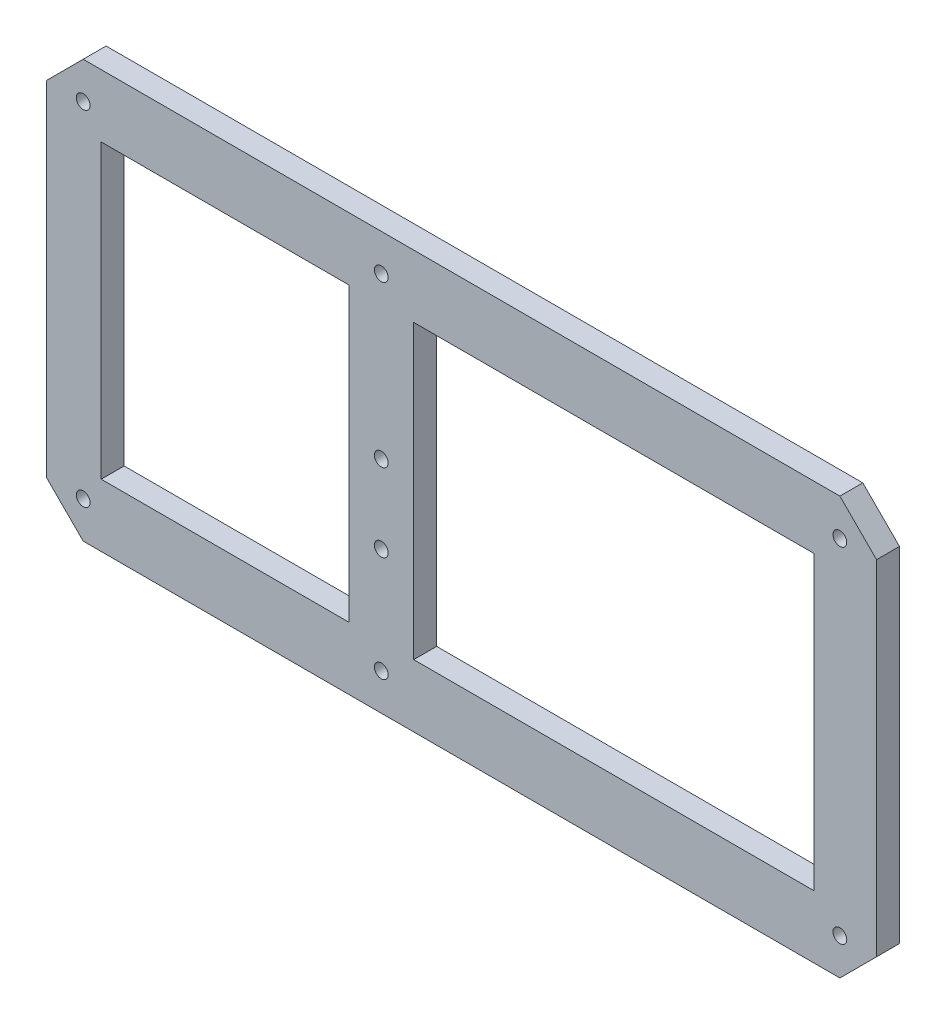
ISO-10303-21;
HEADER;
FILE_DESCRIPTION(('STEP AP214'),'2;1');
FILE_NAME('part.step','',(''),(''),'','','');
FILE_SCHEMA(('AUTOMOTIVE_DESIGN { 1 0 10303 214 1 1 1 1 }'));
ENDSEC;
DATA;
#1=APPLICATION_CONTEXT('core data for automotive mechanical design processes');
#2=APPLICATION_PROTOCOL_DEFINITION('international standard','automotive_design',2000,#1);
#3=PRODUCT_CONTEXT('',#1,'mechanical');
#4=PRODUCT('Part','Part','',(#3));
#5=PRODUCT_RELATED_PRODUCT_CATEGORY('part','',(#4));
#6=PRODUCT_DEFINITION_FORMATION('','',#4);
#7=PRODUCT_DEFINITION_CONTEXT('part definition',#1,'design');
#8=PRODUCT_DEFINITION('design','',#6,#7);
#9=PRODUCT_DEFINITION_SHAPE('','',#8);
#10=(LENGTH_UNIT() NAMED_UNIT(*) SI_UNIT(.MILLI.,.METRE.));
#11=(NAMED_UNIT(*) PLANE_ANGLE_UNIT() SI_UNIT($,.RADIAN.));
#12=(NAMED_UNIT(*) SI_UNIT($,.STERADIAN.) SOLID_ANGLE_UNIT());
#13=UNCERTAINTY_MEASURE_WITH_UNIT(LENGTH_MEASURE(1.E-05),#10,'distance_accuracy_value','');
#14=(GEOMETRIC_REPRESENTATION_CONTEXT(3) GLOBAL_UNCERTAINTY_ASSIGNED_CONTEXT((#13)) GLOBAL_UNIT_ASSIGNED_CONTEXT((#10,
#11,#12)) REPRESENTATION_CONTEXT('',''));
#15=CARTESIAN_POINT('',(0.,0.,0.));
#16=DIRECTION('',(0.,0.,1.));
#17=DIRECTION('',(1.,0.,0.));
#18=AXIS2_PLACEMENT_3D('',#15,#16,#17);
#19=CARTESIAN_POINT('',(0.,-41.9670135344824,5.));
#20=DIRECTION('',(0.,1.,0.));
#21=DIRECTION('',(-1.,0.,0.));
#22=AXIS2_PLACEMENT_3D('',#19,#20,#21);
#23=PLANE('',#22);
#24=DIRECTION('',(1.,0.,0.));
#25=VECTOR('',#24,1.);
#26=CARTESIAN_POINT('',(0.,-41.9670135344824,0.));
#27=LINE('',#26,#25);
#28=CARTESIAN_POINT('',(-68.7558265529049,-41.9670135344824,0.));
#29=VERTEX_POINT('',#28);
#30=CARTESIAN_POINT('',(96.2441734470951,-41.9670135344824,0.));
#31=VERTEX_POINT('',#30);
#32=EDGE_CURVE('E239',#29,#31,#27,.T.);
#33=ORIENTED_EDGE('',*,*,#32,.T.);
#34=DIRECTION('',(0.,0.,-1.));
#35=VECTOR('',#34,1.);
#36=CARTESIAN_POINT('',(96.2441734470951,-41.9670135344824,5.));
#37=LINE('',#36,#35);
#38=CARTESIAN_POINT('',(96.2441734470951,-41.9670135344824,5.));
#39=VERTEX_POINT('',#38);
#40=EDGE_CURVE('E11',#39,#31,#37,.T.);
#41=ORIENTED_EDGE('',*,*,#40,.F.);
#42=DIRECTION('',(1.,0.,0.));
#43=VECTOR('',#42,1.);
#44=CARTESIAN_POINT('',(0.,-41.9670135344824,5.));
#45=LINE('',#44,#43);
#46=CARTESIAN_POINT('',(-68.7558265529049,-41.9670135344824,5.));
#47=VERTEX_POINT('',#46);
#48=EDGE_CURVE('E439',#47,#39,#45,.T.);
#49=ORIENTED_EDGE('',*,*,#48,.F.);
#50=DIRECTION('',(0.,0.,-1.));
#51=VECTOR('',#50,1.);
#52=CARTESIAN_POINT('',(-68.7558265529049,-41.9670135344824,5.));
#53=LINE('',#52,#51);
#54=EDGE_CURVE('E258',#47,#29,#53,.T.);
#55=ORIENTED_EDGE('',*,*,#54,.T.);
#56=EDGE_LOOP('',(#33,#41,#49,#55));
#57=FACE_BOUND('',#56,.T.);
#58=ADVANCED_FACE('F43',(#57),#23,.F.);
#59=CARTESIAN_POINT('',(69.1055934907903,-69.1055934907881,5.));
#60=DIRECTION('',(-0.707106781186559,0.707106781186536,0.));
#61=DIRECTION('',(-0.707106781186536,-0.707106781186559,0.));
#62=AXIS2_PLACEMENT_3D('',#59,#60,#61);
#63=PLANE('',#62);
#64=DIRECTION('',(0.707106781186536,0.707106781186559,0.));
#65=VECTOR('',#64,1.);
#66=CARTESIAN_POINT('',(69.1055934907903,-69.1055934907881,0.));
#67=LINE('',#66,#65);
#68=CARTESIAN_POINT('',(104.244173447095,-33.9670135344821,0.));
#69=VERTEX_POINT('',#68);
#70=EDGE_CURVE('E242',#31,#69,#67,.T.);
#71=ORIENTED_EDGE('',*,*,#70,.T.);
#72=DIRECTION('',(0.,0.,-1.));
#73=VECTOR('',#72,1.);
#74=CARTESIAN_POINT('',(104.244173447095,-33.9670135344821,5.));
#75=LINE('',#74,#73);
#76=CARTESIAN_POINT('',(104.244173447095,-33.9670135344821,5.));
#77=VERTEX_POINT('',#76);
#78=EDGE_CURVE('E53',#77,#69,#75,.T.);
#79=ORIENTED_EDGE('',*,*,#78,.F.);
#80=DIRECTION('',(0.707106781186536,0.707106781186559,0.));
#81=VECTOR('',#80,1.);
#82=CARTESIAN_POINT('',(69.1055934907903,-69.1055934907881,5.));
#83=LINE('',#82,#81);
#84=EDGE_CURVE('E435',#39,#77,#83,.T.);
#85=ORIENTED_EDGE('',*,*,#84,.F.);
#86=ORIENTED_EDGE('',*,*,#40,.T.);
#87=EDGE_LOOP('',(#71,#79,#85,#86));
#88=FACE_BOUND('',#87,.T.);
#89=ADVANCED_FACE('F312',(#88),#63,.F.);
#90=CARTESIAN_POINT('',(104.244173447095,0.,5.));
#91=DIRECTION('',(1.,0.,0.));
#92=DIRECTION('',(0.,1.,0.));
#93=AXIS2_PLACEMENT_3D('',#90,#91,#92);
#94=PLANE('',#93);
#95=DIRECTION('',(0.,-1.,0.));
#96=VECTOR('',#95,1.);
#97=CARTESIAN_POINT('',(104.244173447095,0.,0.));
#98=LINE('',#97,#96);
#99=CARTESIAN_POINT('',(104.244173447095,41.0329864655178,0.));
#100=VERTEX_POINT('',#99);
#101=EDGE_CURVE('E245',#100,#69,#98,.T.);
#102=ORIENTED_EDGE('',*,*,#101,.F.);
#103=DIRECTION('',(0.,0.,-1.));
#104=VECTOR('',#103,1.);
#105=CARTESIAN_POINT('',(104.244173447095,41.0329864655178,5.));
#106=LINE('',#105,#104);
#107=CARTESIAN_POINT('',(104.244173447095,41.0329864655178,5.));
#108=VERTEX_POINT('',#107);
#109=EDGE_CURVE('E265',#108,#100,#106,.T.);
#110=ORIENTED_EDGE('',*,*,#109,.F.);
#111=DIRECTION('',(0.,-1.,0.));
#112=VECTOR('',#111,1.);
#113=CARTESIAN_POINT('',(104.244173447095,0.,5.));
#114=LINE('',#113,#112);
#115=EDGE_CURVE('E433',#108,#77,#114,.T.);
#116=ORIENTED_EDGE('',*,*,#115,.T.);
#117=ORIENTED_EDGE('',*,*,#78,.T.);
#118=EDGE_LOOP('',(#102,#110,#116,#117));
#119=FACE_BOUND('',#118,.T.);
#120=ADVANCED_FACE('F318',(#119),#94,.T.);
#121=CARTESIAN_POINT('',(72.6385799563055,72.6385799563068,5.));
#122=DIRECTION('',(0.707106781186541,0.707106781186554,0.));
#123=DIRECTION('',(-0.707106781186554,0.707106781186541,0.));
#124=AXIS2_PLACEMENT_3D('',#121,#122,#123);
#125=PLANE('',#124);
#126=DIRECTION('',(0.707106781186554,-0.707106781186541,0.));
#127=VECTOR('',#126,1.);
#128=CARTESIAN_POINT('',(72.6385799563055,72.6385799563068,0.));
#129=LINE('',#128,#127);
#130=CARTESIAN_POINT('',(96.2441734470951,49.0329864655176,0.));
#131=VERTEX_POINT('',#130);
#132=EDGE_CURVE('E248',#131,#100,#129,.T.);
#133=ORIENTED_EDGE('',*,*,#132,.F.);
#134=DIRECTION('',(0.,0.,-1.));
#135=VECTOR('',#134,1.);
#136=CARTESIAN_POINT('',(96.2441734470951,49.0329864655176,5.));
#137=LINE('',#136,#135);
#138=CARTESIAN_POINT('',(96.2441734470951,49.0329864655176,5.));
#139=VERTEX_POINT('',#138);
#140=EDGE_CURVE('E263',#139,#131,#137,.T.);
#141=ORIENTED_EDGE('',*,*,#140,.F.);
#142=DIRECTION('',(0.707106781186554,-0.707106781186541,0.));
#143=VECTOR('',#142,1.);
#144=CARTESIAN_POINT('',(72.6385799563055,72.6385799563068,5.));
#145=LINE('',#144,#143);
#146=EDGE_CURVE('E432',#139,#108,#145,.T.);
#147=ORIENTED_EDGE('',*,*,#146,.T.);
#148=ORIENTED_EDGE('',*,*,#109,.T.);
#149=EDGE_LOOP('',(#133,#141,#147,#148));
#150=FACE_BOUND('',#149,.T.);
#151=ADVANCED_FACE('F415',(#150),#125,.T.);
#152=CARTESIAN_POINT('',(0.,49.0329864655176,5.));
#153=DIRECTION('',(0.,1.,0.));
#154=DIRECTION('',(-1.,0.,0.));
#155=AXIS2_PLACEMENT_3D('',#152,#153,#154);
#156=PLANE('',#155);
#157=DIRECTION('',(1.,0.,0.));
#158=VECTOR('',#157,1.);
#159=CARTESIAN_POINT('',(0.,49.0329864655176,0.));
#160=LINE('',#159,#158);
#161=CARTESIAN_POINT('',(-68.7558265529048,49.0329864655176,0.));
#162=VERTEX_POINT('',#161);
#163=EDGE_CURVE('E251',#162,#131,#160,.T.);
#164=ORIENTED_EDGE('',*,*,#163,.F.);
#165=DIRECTION('',(0.,0.,-1.));
#166=VECTOR('',#165,1.);
#167=CARTESIAN_POINT('',(-68.7558265529048,49.0329864655176,5.));
#168=LINE('',#167,#166);
#169=CARTESIAN_POINT('',(-68.7558265529048,49.0329864655176,5.));
#170=VERTEX_POINT('',#169);
#171=EDGE_CURVE('E182',#170,#162,#168,.T.);
#172=ORIENTED_EDGE('',*,*,#171,.F.);
#173=DIRECTION('',(1.,0.,0.));
#174=VECTOR('',#173,1.);
#175=CARTESIAN_POINT('',(0.,49.0329864655176,5.));
#176=LINE('',#175,#174);
#177=EDGE_CURVE('E175',#170,#139,#176,.T.);
#178=ORIENTED_EDGE('',*,*,#177,.T.);
#179=ORIENTED_EDGE('',*,*,#140,.T.);
#180=EDGE_LOOP('',(#164,#172,#178,#179));
#181=FACE_BOUND('',#180,.T.);
#182=ADVANCED_FACE('F412',(#181),#156,.T.);
#183=CARTESIAN_POINT('',(-58.8944065092109,58.8944065092115,5.));
#184=DIRECTION('',(0.707106781186544,-0.707106781186551,0.));
#185=DIRECTION('',(0.707106781186551,0.707106781186544,0.));
#186=AXIS2_PLACEMENT_3D('',#183,#184,#185);
#187=PLANE('',#186);
#188=DIRECTION('',(-0.707106781186551,-0.707106781186544,0.));
#189=VECTOR('',#188,1.);
#190=CARTESIAN_POINT('',(-58.8944065092109,58.8944065092115,0.));
#191=LINE('',#190,#189);
#192=CARTESIAN_POINT('',(-76.7558205432151,41.0329924752074,0.));
#193=VERTEX_POINT('',#192);
#194=EDGE_CURVE('E181',#162,#193,#191,.T.);
#195=ORIENTED_EDGE('',*,*,#194,.T.);
#196=DIRECTION('',(0.,0.,-1.));
#197=VECTOR('',#196,1.);
#198=CARTESIAN_POINT('',(-76.7558205432151,41.0329924752074,5.));
#199=LINE('',#198,#197);
#200=CARTESIAN_POINT('',(-76.7558205432151,41.0329924752074,5.));
#201=VERTEX_POINT('',#200);
#202=EDGE_CURVE('E178',#201,#193,#199,.T.);
#203=ORIENTED_EDGE('',*,*,#202,.F.);
#204=DIRECTION('',(-0.707106781186551,-0.707106781186544,0.));
#205=VECTOR('',#204,1.);
#206=CARTESIAN_POINT('',(-58.8944065092109,58.8944065092115,5.));
#207=LINE('',#206,#205);
#208=EDGE_CURVE('E168',#170,#201,#207,.T.);
#209=ORIENTED_EDGE('',*,*,#208,.F.);
#210=ORIENTED_EDGE('',*,*,#171,.T.);
#211=EDGE_LOOP('',(#195,#203,#209,#210));
#212=FACE_BOUND('',#211,.T.);
#213=ADVANCED_FACE('F179',(#212),#187,.F.);
#214=CARTESIAN_POINT('',(-76.7558205432151,0.,5.));
#215=DIRECTION('',(1.,0.,0.));
#216=DIRECTION('',(0.,1.,0.));
#217=AXIS2_PLACEMENT_3D('',#214,#215,#216);
#218=PLANE('',#217);
#219=DIRECTION('',(0.,-1.,0.));
#220=VECTOR('',#219,1.);
#221=CARTESIAN_POINT('',(-76.7558205432151,0.,0.));
#222=LINE('',#221,#220);
#223=CARTESIAN_POINT('',(-76.7558205432151,-33.9670075247925,0.));
#224=VERTEX_POINT('',#223);
#225=EDGE_CURVE('E115',#193,#224,#222,.T.);
#226=ORIENTED_EDGE('',*,*,#225,.T.);
#227=DIRECTION('',(0.,0.,-1.));
#228=VECTOR('',#227,1.);
#229=CARTESIAN_POINT('',(-76.7558205432151,-33.9670075247925,5.));
#230=LINE('',#229,#228);
#231=CARTESIAN_POINT('',(-76.7558205432151,-33.9670075247925,5.));
#232=VERTEX_POINT('',#231);
#233=EDGE_CURVE('E183',#232,#224,#230,.T.);
#234=ORIENTED_EDGE('',*,*,#233,.F.);
#235=DIRECTION('',(0.,-1.,0.));
#236=VECTOR('',#235,1.);
#237=CARTESIAN_POINT('',(-76.7558205432151,0.,5.));
#238=LINE('',#237,#236);
#239=EDGE_CURVE('E172',#201,#232,#238,.T.);
#240=ORIENTED_EDGE('',*,*,#239,.F.);
#241=ORIENTED_EDGE('',*,*,#202,.T.);
#242=EDGE_LOOP('',(#226,#234,#240,#241));
#243=FACE_BOUND('',#242,.T.);
#244=ADVANCED_FACE('F185',(#243),#218,.F.);
#245=CARTESIAN_POINT('',(-10.8268943647704,0.,5.));
#246=DIRECTION('',(-1.,0.,0.));
#247=DIRECTION('',(0.,-1.,0.));
#248=AXIS2_PLACEMENT_3D('',#245,#246,#247);
#249=PLANE('',#248);
#250=DIRECTION('',(0.,1.,0.));
#251=VECTOR('',#250,1.);
#252=CARTESIAN_POINT('',(-10.8268943647704,0.,0.));
#253=LINE('',#252,#251);
#254=CARTESIAN_POINT('',(-10.8268943647704,-28.31015928499,0.));
#255=VERTEX_POINT('',#254);
#256=CARTESIAN_POINT('',(-10.8268943647704,35.3761322160252,0.));
#257=VERTEX_POINT('',#256);
#258=EDGE_CURVE('E227',#255,#257,#253,.T.);
#259=ORIENTED_EDGE('',*,*,#258,.F.);
#260=DIRECTION('',(0.,0.,-1.));
#261=VECTOR('',#260,1.);
#262=CARTESIAN_POINT('',(-10.8268943647704,-28.31015928499,5.));
#263=LINE('',#262,#261);
#264=CARTESIAN_POINT('',(-10.8268943647704,-28.31015928499,5.));
#265=VERTEX_POINT('',#264);
#266=EDGE_CURVE('E260',#265,#255,#263,.T.);
#267=ORIENTED_EDGE('',*,*,#266,.F.);
#268=DIRECTION('',(0.,1.,0.));
#269=VECTOR('',#268,1.);
#270=CARTESIAN_POINT('',(-10.8268943647704,0.,5.));
#271=LINE('',#270,#269);
#272=CARTESIAN_POINT('',(-10.8268943647704,35.3761322160252,5.));
#273=VERTEX_POINT('',#272);
#274=EDGE_CURVE('E449',#265,#273,#271,.T.);
#275=ORIENTED_EDGE('',*,*,#274,.T.);
#276=DIRECTION('',(0.,0.,-1.));
#277=VECTOR('',#276,1.);
#278=CARTESIAN_POINT('',(-10.8268943647704,35.3761322160252,5.));
#279=LINE('',#278,#277);
#280=EDGE_CURVE('E268',#273,#257,#279,.T.);
#281=ORIENTED_EDGE('',*,*,#280,.T.);
#282=EDGE_LOOP('',(#259,#267,#275,#281));
#283=FACE_BOUND('',#282,.T.);
#284=ADVANCED_FACE('F330',(#283),#249,.T.);
#285=CARTESIAN_POINT('',(0.,-28.31015928499,5.));
#286=DIRECTION('',(0.,1.,0.));
#287=DIRECTION('',(0.,0.,1.));
#288=AXIS2_PLACEMENT_3D('',#285,#286,#287);
#289=PLANE('',#288);
#290=DIRECTION('',(1.,0.,0.));
#291=VECTOR('',#290,1.);
#292=CARTESIAN_POINT('',(0.,-28.31015928499,0.));
#293=LINE('',#292,#291);
#294=CARTESIAN_POINT('',(-64.8268943647704,-28.31015928499,0.));
#295=VERTEX_POINT('',#294);
#296=EDGE_CURVE('E230',#295,#255,#293,.T.);
#297=ORIENTED_EDGE('',*,*,#296,.F.);
#298=DIRECTION('',(0.,0.,-1.));
#299=VECTOR('',#298,1.);
#300=CARTESIAN_POINT('',(-64.8268943647704,-28.31015928499,5.));
#301=LINE('',#300,#299);
#302=CARTESIAN_POINT('',(-64.8268943647704,-28.31015928499,5.));
#303=VERTEX_POINT('',#302);
#304=EDGE_CURVE('E272',#303,#295,#301,.T.);
#305=ORIENTED_EDGE('',*,*,#304,.F.);
#306=DIRECTION('',(1.,0.,0.));
#307=VECTOR('',#306,1.);
#308=CARTESIAN_POINT('',(0.,-28.31015928499,5.));
#309=LINE('',#308,#307);
#310=EDGE_CURVE('E446',#303,#265,#309,.T.);
#311=ORIENTED_EDGE('',*,*,#310,.T.);
#312=ORIENTED_EDGE('',*,*,#266,.T.);
#313=EDGE_LOOP('',(#297,#305,#311,#312));
#314=FACE_BOUND('',#313,.T.);
#315=ADVANCED_FACE('F326',(#314),#289,.T.);
#316=CARTESIAN_POINT('',(-64.8268943647704,0.,5.));
#317=DIRECTION('',(1.,0.,0.));
#318=DIRECTION('',(0.,0.,-1.));
#319=AXIS2_PLACEMENT_3D('',#316,#317,#318);
#320=PLANE('',#319);
#321=DIRECTION('',(0.,-1.,0.));
#322=VECTOR('',#321,1.);
#323=CARTESIAN_POINT('',(-64.8268943647704,0.,0.));
#324=LINE('',#323,#322);
#325=CARTESIAN_POINT('',(-64.8268943647704,35.3761322160252,0.));
#326=VERTEX_POINT('',#325);
#327=EDGE_CURVE('E233',#326,#295,#324,.T.);
#328=ORIENTED_EDGE('',*,*,#327,.F.);
#329=DIRECTION('',(0.,0.,-1.));
#330=VECTOR('',#329,1.);
#331=CARTESIAN_POINT('',(-64.8268943647704,35.3761322160252,5.));
#332=LINE('',#331,#330);
#333=CARTESIAN_POINT('',(-64.8268943647704,35.3761322160252,5.));
#334=VERTEX_POINT('',#333);
#335=EDGE_CURVE('E270',#334,#326,#332,.T.);
#336=ORIENTED_EDGE('',*,*,#335,.F.);
#337=DIRECTION('',(0.,-1.,0.));
#338=VECTOR('',#337,1.);
#339=CARTESIAN_POINT('',(-64.8268943647704,0.,5.));
#340=LINE('',#339,#338);
#341=EDGE_CURVE('E443',#334,#303,#340,.T.);
#342=ORIENTED_EDGE('',*,*,#341,.T.);
#343=ORIENTED_EDGE('',*,*,#304,.T.);
#344=EDGE_LOOP('',(#328,#336,#342,#343));
#345=FACE_BOUND('',#344,.T.);
#346=ADVANCED_FACE('F323',(#345),#320,.T.);
#347=CARTESIAN_POINT('',(3.31524125896056,0.,5.));
#348=DIRECTION('',(1.,0.,0.));
#349=DIRECTION('',(0.,1.,0.));
#350=AXIS2_PLACEMENT_3D('',#347,#348,#349);
#351=PLANE('',#350);
#352=DIRECTION('',(0.,-1.,0.));
#353=VECTOR('',#352,1.);
#354=CARTESIAN_POINT('',(3.31524125896056,0.,0.));
#355=LINE('',#354,#353);
#356=CARTESIAN_POINT('',(3.31524125896056,35.3761322160252,0.));
#357=VERTEX_POINT('',#356);
#358=CARTESIAN_POINT('',(3.31524125896056,-28.31015928499,0.));
#359=VERTEX_POINT('',#358);
#360=EDGE_CURVE('E215',#357,#359,#355,.T.);
#361=ORIENTED_EDGE('',*,*,#360,.F.);
#362=DIRECTION('',(0.,0.,-1.));
#363=VECTOR('',#362,1.);
#364=CARTESIAN_POINT('',(3.31524125896056,35.3761322160252,5.));
#365=LINE('',#364,#363);
#366=CARTESIAN_POINT('',(3.31524125896056,35.3761322160252,5.));
#367=VERTEX_POINT('',#366);
#368=EDGE_CURVE('E47',#367,#357,#365,.T.);
#369=ORIENTED_EDGE('',*,*,#368,.F.);
#370=DIRECTION('',(0.,-1.,0.));
#371=VECTOR('',#370,1.);
#372=CARTESIAN_POINT('',(3.31524125896056,0.,5.));
#373=LINE('',#372,#371);
#374=CARTESIAN_POINT('',(3.31524125896056,-28.31015928499,5.));
#375=VERTEX_POINT('',#374);
#376=EDGE_CURVE('E292',#367,#375,#373,.T.);
#377=ORIENTED_EDGE('',*,*,#376,.T.);
#378=DIRECTION('',(0.,0.,-1.));
#379=VECTOR('',#378,1.);
#380=CARTESIAN_POINT('',(3.31524125896056,-28.31015928499,5.));
#381=LINE('',#380,#379);
#382=EDGE_CURVE('E187',#375,#359,#381,.T.);
#383=ORIENTED_EDGE('',*,*,#382,.T.);
#384=EDGE_LOOP('',(#361,#369,#377,#383));
#385=FACE_BOUND('',#384,.T.);
#386=ADVANCED_FACE('F291',(#385),#351,.T.);
#387=CARTESIAN_POINT('',(0.,35.3761322160252,5.));
#388=DIRECTION('',(0.,1.,0.));
#389=DIRECTION('',(-1.,0.,0.));
#390=AXIS2_PLACEMENT_3D('',#387,#388,#389);
#391=PLANE('',#390);
#392=DIRECTION('',(1.,0.,0.));
#393=VECTOR('',#392,1.);
#394=CARTESIAN_POINT('',(0.,35.3761322160252,0.));
#395=LINE('',#394,#393);
#396=CARTESIAN_POINT('',(90.5873191976027,35.3761322160252,0.));
#397=VERTEX_POINT('',#396);
#398=EDGE_CURVE('E218',#357,#397,#395,.T.);
#399=ORIENTED_EDGE('',*,*,#398,.T.);
#400=DIRECTION('',(0.,0.,-1.));
#401=VECTOR('',#400,1.);
#402=CARTESIAN_POINT('',(90.5873191976027,35.3761322160252,5.));
#403=LINE('',#402,#401);
#404=CARTESIAN_POINT('',(90.5873191976027,35.3761322160252,5.));
#405=VERTEX_POINT('',#404);
#406=EDGE_CURVE('E277',#405,#397,#403,.T.);
#407=ORIENTED_EDGE('',*,*,#406,.F.);
#408=DIRECTION('',(1.,0.,0.));
#409=VECTOR('',#408,1.);
#410=CARTESIAN_POINT('',(0.,35.3761322160252,5.));
#411=LINE('',#410,#409);
#412=EDGE_CURVE('E285',#367,#405,#411,.T.);
#413=ORIENTED_EDGE('',*,*,#412,.F.);
#414=ORIENTED_EDGE('',*,*,#368,.T.);
#415=EDGE_LOOP('',(#399,#407,#413,#414));
#416=FACE_BOUND('',#415,.T.);
#417=ADVANCED_FACE('F284',(#416),#391,.F.);
#418=CARTESIAN_POINT('',(90.5873191976027,0.,5.));
#419=DIRECTION('',(-1.,0.,0.));
#420=DIRECTION('',(0.,-1.,0.));
#421=AXIS2_PLACEMENT_3D('',#418,#419,#420);
#422=PLANE('',#421);
#423=DIRECTION('',(0.,1.,0.));
#424=VECTOR('',#423,1.);
#425=CARTESIAN_POINT('',(90.5873191976027,0.,0.));
#426=LINE('',#425,#424);
#427=CARTESIAN_POINT('',(90.5873191976027,-28.31015928499,0.));
#428=VERTEX_POINT('',#427);
#429=EDGE_CURVE('E221',#428,#397,#426,.T.);
#430=ORIENTED_EDGE('',*,*,#429,.F.);
#431=DIRECTION('',(0.,0.,-1.));
#432=VECTOR('',#431,1.);
#433=CARTESIAN_POINT('',(90.5873191976027,-28.31015928499,5.));
#434=LINE('',#433,#432);
#435=CARTESIAN_POINT('',(90.5873191976027,-28.31015928499,5.));
#436=VERTEX_POINT('',#435);
#437=EDGE_CURVE('E276',#436,#428,#434,.T.);
#438=ORIENTED_EDGE('',*,*,#437,.F.);
#439=DIRECTION('',(0.,1.,0.));
#440=VECTOR('',#439,1.);
#441=CARTESIAN_POINT('',(90.5873191976027,0.,5.));
#442=LINE('',#441,#440);
#443=EDGE_CURVE('E453',#436,#405,#442,.T.);
#444=ORIENTED_EDGE('',*,*,#443,.T.);
#445=ORIENTED_EDGE('',*,*,#406,.T.);
#446=EDGE_LOOP('',(#430,#438,#444,#445));
#447=FACE_BOUND('',#446,.T.);
#448=ADVANCED_FACE('F299',(#447),#422,.T.);
#449=CARTESIAN_POINT('',(0.,35.3761322160252,5.));
#450=DIRECTION('',(0.,1.,0.));
#451=DIRECTION('',(0.,0.,1.));
#452=AXIS2_PLACEMENT_3D('',#449,#450,#451);
#453=PLANE('',#452);
#454=DIRECTION('',(1.,0.,0.));
#455=VECTOR('',#454,1.);
#456=CARTESIAN_POINT('',(0.,35.3761322160252,0.));
#457=LINE('',#456,#455);
#458=EDGE_CURVE('E236',#326,#257,#457,.T.);
#459=ORIENTED_EDGE('',*,*,#458,.T.);
#460=ORIENTED_EDGE('',*,*,#280,.F.);
#461=DIRECTION('',(1.,0.,0.));
#462=VECTOR('',#461,1.);
#463=CARTESIAN_POINT('',(0.,35.3761322160252,5.));
#464=LINE('',#463,#462);
#465=EDGE_CURVE('E441',#334,#273,#464,.T.);
#466=ORIENTED_EDGE('',*,*,#465,.F.);
#467=ORIENTED_EDGE('',*,*,#335,.T.);
#468=EDGE_LOOP('',(#459,#460,#466,#467));
#469=FACE_BOUND('',#468,.T.);
#470=ADVANCED_FACE('F301',(#469),#453,.F.);
#471=CARTESIAN_POINT('',(0.,-28.31015928499,5.));
#472=DIRECTION('',(0.,1.,0.));
#473=DIRECTION('',(0.,0.,1.));
#474=AXIS2_PLACEMENT_3D('',#471,#472,#473);
#475=PLANE('',#474);
#476=DIRECTION('',(1.,0.,0.));
#477=VECTOR('',#476,1.);
#478=CARTESIAN_POINT('',(0.,-28.31015928499,0.));
#479=LINE('',#478,#477);
#480=EDGE_CURVE('E224',#359,#428,#479,.T.);
#481=ORIENTED_EDGE('',*,*,#480,.F.);
#482=ORIENTED_EDGE('',*,*,#382,.F.);
#483=DIRECTION('',(1.,0.,0.));
#484=VECTOR('',#483,1.);
#485=CARTESIAN_POINT('',(0.,-28.31015928499,5.));
#486=LINE('',#485,#484);
#487=EDGE_CURVE('E297',#375,#436,#486,.T.);
#488=ORIENTED_EDGE('',*,*,#487,.T.);
#489=ORIENTED_EDGE('',*,*,#437,.T.);
#490=EDGE_LOOP('',(#481,#482,#488,#489));
#491=FACE_BOUND('',#490,.T.);
#492=ADVANCED_FACE('F296',(#491),#475,.T.);
#493=CARTESIAN_POINT('',(-3.75582655290491,6.03298646551761,5.));
#494=DIRECTION('',(0.,0.,-1.));
#495=DIRECTION('',(-1.,0.,0.));
#496=AXIS2_PLACEMENT_3D('',#493,#494,#495);
#497=CYLINDRICAL_SURFACE('',#496,1.5);
#498=CARTESIAN_POINT('',(-3.75582655290491,6.03298646551761,5.));
#499=DIRECTION('',(0.,0.,1.));
#500=DIRECTION('',(1.,0.,0.));
#501=AXIS2_PLACEMENT_3D('',#498,#499,#500);
#502=CIRCLE('',#501,1.5);
#503=CARTESIAN_POINT('',(-2.25582655290491,6.03298646551761,5.));
#504=VERTEX_POINT('',#503);
#505=EDGE_CURVE('E457',#504,#504,#502,.T.);
#506=ORIENTED_EDGE('',*,*,#505,.T.);
#507=EDGE_LOOP('',(#506));
#508=FACE_BOUND('',#507,.T.);
#509=CARTESIAN_POINT('',(-3.75582655290491,6.03298646551761,0.));
#510=DIRECTION('',(0.,0.,1.));
#511=DIRECTION('',(1.,0.,0.));
#512=AXIS2_PLACEMENT_3D('',#509,#510,#511);
#513=CIRCLE('',#512,1.5);
#514=CARTESIAN_POINT('',(-2.25582655290491,6.03298646551761,0.));
#515=VERTEX_POINT('',#514);
#516=EDGE_CURVE('E212',#515,#515,#513,.T.);
#517=ORIENTED_EDGE('',*,*,#516,.F.);
#518=EDGE_LOOP('',(#517));
#519=FACE_BOUND('',#518,.T.);
#520=ADVANCED_FACE('F335',(#508,#519),#497,.F.);
#521=CARTESIAN_POINT('',(-3.75582655290491,-10.9670135344824,5.));
#522=DIRECTION('',(0.,0.,-1.));
#523=DIRECTION('',(-1.,0.,0.));
#524=AXIS2_PLACEMENT_3D('',#521,#522,#523);
#525=CYLINDRICAL_SURFACE('',#524,1.5);
#526=CARTESIAN_POINT('',(-3.75582655290491,-10.9670135344824,5.));
#527=DIRECTION('',(0.,0.,1.));
#528=DIRECTION('',(1.,0.,0.));
#529=AXIS2_PLACEMENT_3D('',#526,#527,#528);
#530=CIRCLE('',#529,1.5);
#531=CARTESIAN_POINT('',(-2.25582655290491,-10.9670135344824,5.));
#532=VERTEX_POINT('',#531);
#533=EDGE_CURVE('E459',#532,#532,#530,.T.);
#534=ORIENTED_EDGE('',*,*,#533,.T.);
#535=EDGE_LOOP('',(#534));
#536=FACE_BOUND('',#535,.T.);
#537=CARTESIAN_POINT('',(-3.75582655290491,-10.9670135344824,0.));
#538=DIRECTION('',(0.,0.,1.));
#539=DIRECTION('',(1.,0.,0.));
#540=AXIS2_PLACEMENT_3D('',#537,#538,#539);
#541=CIRCLE('',#540,1.5);
#542=CARTESIAN_POINT('',(-2.25582655290491,-10.9670135344824,0.));
#543=VERTEX_POINT('',#542);
#544=EDGE_CURVE('E209',#543,#543,#541,.T.);
#545=ORIENTED_EDGE('',*,*,#544,.F.);
#546=EDGE_LOOP('',(#545));
#547=FACE_BOUND('',#546,.T.);
#548=ADVANCED_FACE('F339',(#536,#547),#525,.F.);
#549=CARTESIAN_POINT('',(-68.7558265529048,41.0329924752074,5.));
#550=DIRECTION('',(0.,0.,-1.));
#551=DIRECTION('',(-1.,0.,0.));
#552=AXIS2_PLACEMENT_3D('',#549,#550,#551);
#553=CYLINDRICAL_SURFACE('',#552,1.5);
#554=CARTESIAN_POINT('',(-68.7558265529048,41.0329924752074,5.));
#555=DIRECTION('',(0.,0.,1.));
#556=DIRECTION('',(1.,0.,0.));
#557=AXIS2_PLACEMENT_3D('',#554,#555,#556);
#558=CIRCLE('',#557,1.5);
#559=CARTESIAN_POINT('',(-67.2558265529048,41.0329924752074,5.));
#560=VERTEX_POINT('',#559);
#561=EDGE_CURVE('E462',#560,#560,#558,.T.);
#562=ORIENTED_EDGE('',*,*,#561,.T.);
#563=EDGE_LOOP('',(#562));
#564=FACE_BOUND('',#563,.T.);
#565=CARTESIAN_POINT('',(-68.7558265529048,41.0329924752074,0.));
#566=DIRECTION('',(0.,0.,1.));
#567=DIRECTION('',(1.,0.,0.));
#568=AXIS2_PLACEMENT_3D('',#565,#566,#567);
#569=CIRCLE('',#568,1.5);
#570=CARTESIAN_POINT('',(-67.2558265529048,41.0329924752074,0.));
#571=VERTEX_POINT('',#570);
#572=EDGE_CURVE('E206',#571,#571,#569,.T.);
#573=ORIENTED_EDGE('',*,*,#572,.F.);
#574=EDGE_LOOP('',(#573));
#575=FACE_BOUND('',#574,.T.);
#576=ADVANCED_FACE('F345',(#564,#575),#553,.F.);
#577=CARTESIAN_POINT('',(-3.75582655290491,41.0329864655176,5.));
#578=DIRECTION('',(0.,0.,-1.));
#579=DIRECTION('',(-1.,0.,0.));
#580=AXIS2_PLACEMENT_3D('',#577,#578,#579);
#581=CYLINDRICAL_SURFACE('',#580,1.5);
#582=CARTESIAN_POINT('',(-3.75582655290491,41.0329864655176,5.));
#583=DIRECTION('',(0.,0.,1.));
#584=DIRECTION('',(1.,0.,0.));
#585=AXIS2_PLACEMENT_3D('',#582,#583,#584);
#586=CIRCLE('',#585,1.5);
#587=CARTESIAN_POINT('',(-2.25582655290491,41.0329864655176,5.));
#588=VERTEX_POINT('',#587);
#589=EDGE_CURVE('E465',#588,#588,#586,.T.);
#590=ORIENTED_EDGE('',*,*,#589,.T.);
#591=EDGE_LOOP('',(#590));
#592=FACE_BOUND('',#591,.T.);
#593=CARTESIAN_POINT('',(-3.75582655290491,41.0329864655176,0.));
#594=DIRECTION('',(0.,0.,1.));
#595=DIRECTION('',(1.,0.,0.));
#596=AXIS2_PLACEMENT_3D('',#593,#594,#595);
#597=CIRCLE('',#596,1.5);
#598=CARTESIAN_POINT('',(-2.25582655290491,41.0329864655176,0.));
#599=VERTEX_POINT('',#598);
#600=EDGE_CURVE('E203',#599,#599,#597,.T.);
#601=ORIENTED_EDGE('',*,*,#600,.F.);
#602=EDGE_LOOP('',(#601));
#603=FACE_BOUND('',#602,.T.);
#604=ADVANCED_FACE('F354',(#592,#603),#581,.F.);
#605=CARTESIAN_POINT('',(-3.7558265529049,-33.9670135344824,5.));
#606=DIRECTION('',(0.,0.,-1.));
#607=DIRECTION('',(-1.,0.,0.));
#608=AXIS2_PLACEMENT_3D('',#605,#606,#607);
#609=CYLINDRICAL_SURFACE('',#608,1.5);
#610=CARTESIAN_POINT('',(-3.7558265529049,-33.9670135344824,5.));
#611=DIRECTION('',(0.,0.,1.));
#612=DIRECTION('',(1.,0.,0.));
#613=AXIS2_PLACEMENT_3D('',#610,#611,#612);
#614=CIRCLE('',#613,1.5);
#615=CARTESIAN_POINT('',(-2.2558265529049,-33.9670135344824,5.));
#616=VERTEX_POINT('',#615);
#617=EDGE_CURVE('E468',#616,#616,#614,.T.);
#618=ORIENTED_EDGE('',*,*,#617,.T.);
#619=EDGE_LOOP('',(#618));
#620=FACE_BOUND('',#619,.T.);
#621=CARTESIAN_POINT('',(-3.7558265529049,-33.9670135344824,0.));
#622=DIRECTION('',(0.,0.,1.));
#623=DIRECTION('',(1.,0.,0.));
#624=AXIS2_PLACEMENT_3D('',#621,#622,#623);
#625=CIRCLE('',#624,1.5);
#626=CARTESIAN_POINT('',(-2.2558265529049,-33.9670135344824,0.));
#627=VERTEX_POINT('',#626);
#628=EDGE_CURVE('E200',#627,#627,#625,.T.);
#629=ORIENTED_EDGE('',*,*,#628,.F.);
#630=EDGE_LOOP('',(#629));
#631=FACE_BOUND('',#630,.T.);
#632=ADVANCED_FACE('F358',(#620,#631),#609,.F.);
#633=CARTESIAN_POINT('',(-68.7558265529049,-33.9670075247925,5.));
#634=DIRECTION('',(0.,0.,-1.));
#635=DIRECTION('',(-1.,0.,0.));
#636=AXIS2_PLACEMENT_3D('',#633,#634,#635);
#637=CYLINDRICAL_SURFACE('',#636,1.5);
#638=CARTESIAN_POINT('',(-68.7558265529049,-33.9670075247925,5.));
#639=DIRECTION('',(0.,0.,1.));
#640=DIRECTION('',(1.,0.,0.));
#641=AXIS2_PLACEMENT_3D('',#638,#639,#640);
#642=CIRCLE('',#641,1.5);
#643=CARTESIAN_POINT('',(-67.2558265529049,-33.9670075247925,5.));
#644=VERTEX_POINT('',#643);
#645=EDGE_CURVE('E471',#644,#644,#642,.T.);
#646=ORIENTED_EDGE('',*,*,#645,.T.);
#647=EDGE_LOOP('',(#646));
#648=FACE_BOUND('',#647,.T.);
#649=CARTESIAN_POINT('',(-68.7558265529049,-33.9670075247925,0.));
#650=DIRECTION('',(0.,0.,1.));
#651=DIRECTION('',(1.,0.,0.));
#652=AXIS2_PLACEMENT_3D('',#649,#650,#651);
#653=CIRCLE('',#652,1.5);
#654=CARTESIAN_POINT('',(-67.2558265529049,-33.9670075247925,0.));
#655=VERTEX_POINT('',#654);
#656=EDGE_CURVE('E197',#655,#655,#653,.T.);
#657=ORIENTED_EDGE('',*,*,#656,.F.);
#658=EDGE_LOOP('',(#657));
#659=FACE_BOUND('',#658,.T.);
#660=ADVANCED_FACE('F362',(#648,#659),#637,.F.);
#661=CARTESIAN_POINT('',(96.2441734470951,-33.9670135344824,5.));
#662=DIRECTION('',(0.,0.,-1.));
#663=DIRECTION('',(-1.,0.,0.));
#664=AXIS2_PLACEMENT_3D('',#661,#662,#663);
#665=CYLINDRICAL_SURFACE('',#664,1.5);
#666=CARTESIAN_POINT('',(96.2441734470951,-33.9670135344824,5.));
#667=DIRECTION('',(0.,0.,1.));
#668=DIRECTION('',(1.,0.,0.));
#669=AXIS2_PLACEMENT_3D('',#666,#667,#668);
#670=CIRCLE('',#669,1.5);
#671=CARTESIAN_POINT('',(97.7441734470951,-33.9670135344824,5.));
#672=VERTEX_POINT('',#671);
#673=EDGE_CURVE('E377',#672,#672,#670,.T.);
#674=ORIENTED_EDGE('',*,*,#673,.T.);
#675=EDGE_LOOP('',(#674));
#676=FACE_BOUND('',#675,.T.);
#677=CARTESIAN_POINT('',(96.2441734470951,-33.9670135344824,0.));
#678=DIRECTION('',(0.,0.,1.));
#679=DIRECTION('',(1.,0.,0.));
#680=AXIS2_PLACEMENT_3D('',#677,#678,#679);
#681=CIRCLE('',#680,1.5);
#682=CARTESIAN_POINT('',(97.7441734470951,-33.9670135344824,0.));
#683=VERTEX_POINT('',#682);
#684=EDGE_CURVE('E194',#683,#683,#681,.T.);
#685=ORIENTED_EDGE('',*,*,#684,.F.);
#686=EDGE_LOOP('',(#685));
#687=FACE_BOUND('',#686,.T.);
#688=ADVANCED_FACE('F365',(#676,#687),#665,.F.);
#689=CARTESIAN_POINT('',(96.2441734470951,41.0329864655176,5.));
#690=DIRECTION('',(0.,0.,-1.));
#691=DIRECTION('',(-1.,0.,0.));
#692=AXIS2_PLACEMENT_3D('',#689,#690,#691);
#693=CYLINDRICAL_SURFACE('',#692,1.5);
#694=CARTESIAN_POINT('',(96.2441734470951,41.0329864655176,5.));
#695=DIRECTION('',(0.,0.,1.));
#696=DIRECTION('',(1.,0.,0.));
#697=AXIS2_PLACEMENT_3D('',#694,#695,#696);
#698=CIRCLE('',#697,1.5);
#699=CARTESIAN_POINT('',(97.7441734470951,41.0329864655176,5.));
#700=VERTEX_POINT('',#699);
#701=EDGE_CURVE('E257',#700,#700,#698,.T.);
#702=ORIENTED_EDGE('',*,*,#701,.T.);
#703=EDGE_LOOP('',(#702));
#704=FACE_BOUND('',#703,.T.);
#705=CARTESIAN_POINT('',(96.2441734470951,41.0329864655176,0.));
#706=DIRECTION('',(0.,0.,1.));
#707=DIRECTION('',(1.,0.,0.));
#708=AXIS2_PLACEMENT_3D('',#705,#706,#707);
#709=CIRCLE('',#708,1.5);
#710=CARTESIAN_POINT('',(97.7441734470951,41.0329864655176,0.));
#711=VERTEX_POINT('',#710);
#712=EDGE_CURVE('E191',#711,#711,#709,.T.);
#713=ORIENTED_EDGE('',*,*,#712,.F.);
#714=EDGE_LOOP('',(#713));
#715=FACE_BOUND('',#714,.T.);
#716=ADVANCED_FACE('F45',(#704,#715),#693,.F.);
#717=CARTESIAN_POINT('',(-55.3614716938192,-55.3613885175629,5.));
#718=DIRECTION('',(0.707107312372904,0.707106249999792,0.));
#719=DIRECTION('',(-0.707106249999792,0.707107312372904,0.));
#720=AXIS2_PLACEMENT_3D('',#717,#718,#719);
#721=PLANE('',#720);
#722=DIRECTION('',(0.707106249999792,-0.707107312372904,0.));
#723=VECTOR('',#722,1.);
#724=CARTESIAN_POINT('',(-55.3614716938192,-55.3613885175629,0.));
#725=LINE('',#724,#723);
#726=EDGE_CURVE('E121',#224,#29,#725,.T.);
#727=ORIENTED_EDGE('',*,*,#726,.T.);
#728=ORIENTED_EDGE('',*,*,#54,.F.);
#729=DIRECTION('',(0.707106249999792,-0.707107312372904,0.));
#730=VECTOR('',#729,1.);
#731=CARTESIAN_POINT('',(-55.3614716938192,-55.3613885175629,5.));
#732=LINE('',#731,#730);
#733=EDGE_CURVE('E62',#232,#47,#732,.T.);
#734=ORIENTED_EDGE('',*,*,#733,.F.);
#735=ORIENTED_EDGE('',*,*,#233,.T.);
#736=EDGE_LOOP('',(#727,#728,#734,#735));
#737=FACE_BOUND('',#736,.T.);
#738=ADVANCED_FACE('F372',(#737),#721,.F.);
#739=CARTESIAN_POINT('',(0.,0.,5.));
#740=DIRECTION('',(0.,0.,1.));
#741=DIRECTION('',(1.,0.,0.));
#742=AXIS2_PLACEMENT_3D('',#739,#740,#741);
#743=PLANE('',#742);
#744=ORIENTED_EDGE('',*,*,#701,.F.);
#745=EDGE_LOOP('',(#744));
#746=FACE_BOUND('',#745,.T.);
#747=ORIENTED_EDGE('',*,*,#673,.F.);
#748=EDGE_LOOP('',(#747));
#749=FACE_BOUND('',#748,.T.);
#750=ORIENTED_EDGE('',*,*,#645,.F.);
#751=EDGE_LOOP('',(#750));
#752=FACE_BOUND('',#751,.T.);
#753=ORIENTED_EDGE('',*,*,#617,.F.);
#754=EDGE_LOOP('',(#753));
#755=FACE_BOUND('',#754,.T.);
#756=ORIENTED_EDGE('',*,*,#589,.F.);
#757=EDGE_LOOP('',(#756));
#758=FACE_BOUND('',#757,.T.);
#759=ORIENTED_EDGE('',*,*,#561,.F.);
#760=EDGE_LOOP('',(#759));
#761=FACE_BOUND('',#760,.T.);
#762=ORIENTED_EDGE('',*,*,#533,.F.);
#763=EDGE_LOOP('',(#762));
#764=FACE_BOUND('',#763,.T.);
#765=ORIENTED_EDGE('',*,*,#505,.F.);
#766=EDGE_LOOP('',(#765));
#767=FACE_BOUND('',#766,.T.);
#768=ORIENTED_EDGE('',*,*,#376,.F.);
#769=ORIENTED_EDGE('',*,*,#412,.T.);
#770=ORIENTED_EDGE('',*,*,#443,.F.);
#771=ORIENTED_EDGE('',*,*,#487,.F.);
#772=EDGE_LOOP('',(#768,#769,#770,#771));
#773=FACE_BOUND('',#772,.T.);
#774=ORIENTED_EDGE('',*,*,#274,.F.);
#775=ORIENTED_EDGE('',*,*,#310,.F.);
#776=ORIENTED_EDGE('',*,*,#341,.F.);
#777=ORIENTED_EDGE('',*,*,#465,.T.);
#778=EDGE_LOOP('',(#774,#775,#776,#777));
#779=FACE_BOUND('',#778,.T.);
#780=ORIENTED_EDGE('',*,*,#48,.T.);
#781=ORIENTED_EDGE('',*,*,#84,.T.);
#782=ORIENTED_EDGE('',*,*,#115,.F.);
#783=ORIENTED_EDGE('',*,*,#146,.F.);
#784=ORIENTED_EDGE('',*,*,#177,.F.);
#785=ORIENTED_EDGE('',*,*,#208,.T.);
#786=ORIENTED_EDGE('',*,*,#239,.T.);
#787=ORIENTED_EDGE('',*,*,#733,.T.);
#788=EDGE_LOOP('',(#780,#781,#782,#783,#784,#785,#786,#787));
#789=FACE_BOUND('',#788,.T.);
#790=ADVANCED_FACE('F170',(#746,#749,#752,#755,#758,#761,#764,#767,#773,#779,#789),#743,.T.);
#791=CARTESIAN_POINT('',(0.,0.,0.));
#792=DIRECTION('',(0.,0.,1.));
#793=DIRECTION('',(1.,0.,0.));
#794=AXIS2_PLACEMENT_3D('',#791,#792,#793);
#795=PLANE('',#794);
#796=ORIENTED_EDGE('',*,*,#712,.T.);
#797=EDGE_LOOP('',(#796));
#798=FACE_BOUND('',#797,.T.);
#799=ORIENTED_EDGE('',*,*,#684,.T.);
#800=EDGE_LOOP('',(#799));
#801=FACE_BOUND('',#800,.T.);
#802=ORIENTED_EDGE('',*,*,#656,.T.);
#803=EDGE_LOOP('',(#802));
#804=FACE_BOUND('',#803,.T.);
#805=ORIENTED_EDGE('',*,*,#628,.T.);
#806=EDGE_LOOP('',(#805));
#807=FACE_BOUND('',#806,.T.);
#808=ORIENTED_EDGE('',*,*,#600,.T.);
#809=EDGE_LOOP('',(#808));
#810=FACE_BOUND('',#809,.T.);
#811=ORIENTED_EDGE('',*,*,#572,.T.);
#812=EDGE_LOOP('',(#811));
#813=FACE_BOUND('',#812,.T.);
#814=ORIENTED_EDGE('',*,*,#544,.T.);
#815=EDGE_LOOP('',(#814));
#816=FACE_BOUND('',#815,.T.);
#817=ORIENTED_EDGE('',*,*,#516,.T.);
#818=EDGE_LOOP('',(#817));
#819=FACE_BOUND('',#818,.T.);
#820=ORIENTED_EDGE('',*,*,#360,.T.);
#821=ORIENTED_EDGE('',*,*,#480,.T.);
#822=ORIENTED_EDGE('',*,*,#429,.T.);
#823=ORIENTED_EDGE('',*,*,#398,.F.);
#824=EDGE_LOOP('',(#820,#821,#822,#823));
#825=FACE_BOUND('',#824,.T.);
#826=ORIENTED_EDGE('',*,*,#258,.T.);
#827=ORIENTED_EDGE('',*,*,#458,.F.);
#828=ORIENTED_EDGE('',*,*,#327,.T.);
#829=ORIENTED_EDGE('',*,*,#296,.T.);
#830=EDGE_LOOP('',(#826,#827,#828,#829));
#831=FACE_BOUND('',#830,.T.);
#832=ORIENTED_EDGE('',*,*,#32,.F.);
#833=ORIENTED_EDGE('',*,*,#726,.F.);
#834=ORIENTED_EDGE('',*,*,#225,.F.);
#835=ORIENTED_EDGE('',*,*,#194,.F.);
#836=ORIENTED_EDGE('',*,*,#163,.T.);
#837=ORIENTED_EDGE('',*,*,#132,.T.);
#838=ORIENTED_EDGE('',*,*,#101,.T.);
#839=ORIENTED_EDGE('',*,*,#70,.F.);
#840=EDGE_LOOP('',(#832,#833,#834,#835,#836,#837,#838,#839));
#841=FACE_BOUND('',#840,.T.);
#842=ADVANCED_FACE('F288',(#798,#801,#804,#807,#810,#813,#816,#819,#825,#831,#841),#795,.F.);
#843=CLOSED_SHELL('',(#58,#89,#120,#151,#182,#213,#244,#284,#315,#346,#386,#417,#448,#470,#492,
#520,#548,#576,#604,#632,#660,#688,#716,#738,#790,#842));
#844=MANIFOLD_SOLID_BREP('B2',#843);
#845=ADVANCED_BREP_SHAPE_REPRESENTATION('',(#18,#844),#14);
#846=SHAPE_DEFINITION_REPRESENTATION(#9,#845);
ENDSEC;
END-ISO-10303-21;
